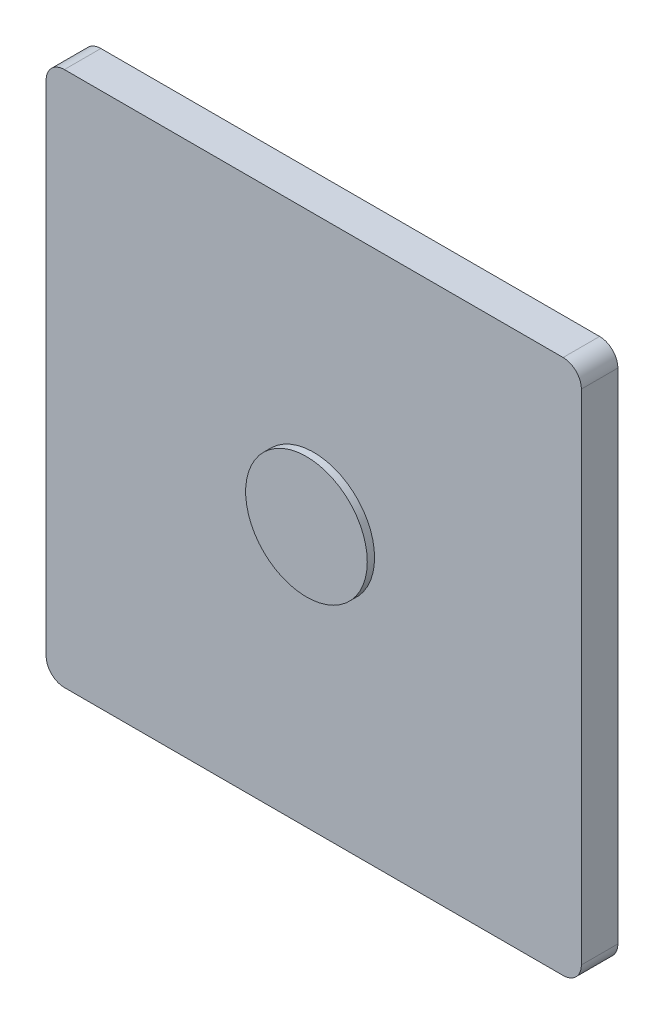
ISO-10303-21;
HEADER;
FILE_DESCRIPTION(('STEP AP214'),'2;1');
FILE_NAME('part.step','',(''),(''),'','','');
FILE_SCHEMA(('AUTOMOTIVE_DESIGN { 1 0 10303 214 1 1 1 1 }'));
ENDSEC;
DATA;
#1=APPLICATION_CONTEXT('core data for automotive mechanical design processes');
#2=APPLICATION_PROTOCOL_DEFINITION('international standard','automotive_design',2000,#1);
#3=PRODUCT_CONTEXT('',#1,'mechanical');
#4=PRODUCT('Part','Part','',(#3));
#5=PRODUCT_RELATED_PRODUCT_CATEGORY('part','',(#4));
#6=PRODUCT_DEFINITION_FORMATION('','',#4);
#7=PRODUCT_DEFINITION_CONTEXT('part definition',#1,'design');
#8=PRODUCT_DEFINITION('design','',#6,#7);
#9=PRODUCT_DEFINITION_SHAPE('','',#8);
#10=(LENGTH_UNIT() NAMED_UNIT(*) SI_UNIT(.MILLI.,.METRE.));
#11=(NAMED_UNIT(*) PLANE_ANGLE_UNIT() SI_UNIT($,.RADIAN.));
#12=(NAMED_UNIT(*) SI_UNIT($,.STERADIAN.) SOLID_ANGLE_UNIT());
#13=UNCERTAINTY_MEASURE_WITH_UNIT(LENGTH_MEASURE(1.E-05),#10,'distance_accuracy_value','');
#14=(GEOMETRIC_REPRESENTATION_CONTEXT(3) GLOBAL_UNCERTAINTY_ASSIGNED_CONTEXT((#13)) GLOBAL_UNIT_ASSIGNED_CONTEXT((#10,
#11,#12)) REPRESENTATION_CONTEXT('',''));
#15=CARTESIAN_POINT('',(0.,0.,0.));
#16=DIRECTION('',(0.,0.,1.));
#17=DIRECTION('',(1.,0.,0.));
#18=AXIS2_PLACEMENT_3D('',#15,#16,#17);
#19=CARTESIAN_POINT('',(-20.4999999991426,20.5,3.));
#20=DIRECTION('',(0.,0.,1.));
#21=DIRECTION('',(1.,0.,0.));
#22=AXIS2_PLACEMENT_3D('',#19,#20,#21);
#23=PLANE('',#22);
#24=DIRECTION('',(0.,-1.,0.));
#25=VECTOR('',#24,1.);
#26=CARTESIAN_POINT('',(-22.0000000004282,-20.500000000428,3.));
#27=LINE('',#26,#25);
#28=CARTESIAN_POINT('',(-22.0000000004283,20.5,3.));
#29=VERTEX_POINT('',#28);
#30=CARTESIAN_POINT('',(-22.0000000002139,-20.500000000428,3.));
#31=VERTEX_POINT('',#30);
#32=EDGE_CURVE('E50',#29,#31,#27,.T.);
#33=ORIENTED_EDGE('',*,*,#32,.T.);
#34=CARTESIAN_POINT('',(-20.4999999987139,-20.500000000428,3.));
#35=DIRECTION('',(0.,0.,1.));
#36=DIRECTION('',(1.,0.,0.));
#37=AXIS2_PLACEMENT_3D('',#34,#35,#36);
#38=CIRCLE('',#37,1.50000000150003);
#39=CARTESIAN_POINT('',(-20.4999999987139,-22.0000000017137,3.));
#40=VERTEX_POINT('',#39);
#41=EDGE_CURVE('E93',#31,#40,#38,.T.);
#42=ORIENTED_EDGE('',*,*,#41,.T.);
#43=DIRECTION('',(1.,0.,0.));
#44=VECTOR('',#43,1.);
#45=CARTESIAN_POINT('',(1.28580863396755E-09,-22.0000000017137,3.));
#46=LINE('',#45,#44);
#47=CARTESIAN_POINT('',(20.5000000017142,-22.0000000014993,3.));
#48=VERTEX_POINT('',#47);
#49=EDGE_CURVE('E163',#40,#48,#46,.T.);
#50=ORIENTED_EDGE('',*,*,#49,.T.);
#51=CARTESIAN_POINT('',(20.5000000017142,-20.4999999999993,3.));
#52=DIRECTION('',(0.,0.,1.));
#53=DIRECTION('',(1.,0.,0.));
#54=AXIS2_PLACEMENT_3D('',#51,#52,#53);
#55=CIRCLE('',#54,1.50000000150004);
#56=CARTESIAN_POINT('',(22.0000000029998,-20.4999999999993,3.));
#57=VERTEX_POINT('',#56);
#58=EDGE_CURVE('E175',#48,#57,#55,.T.);
#59=ORIENTED_EDGE('',*,*,#58,.T.);
#60=DIRECTION('',(0.,1.,0.));
#61=VECTOR('',#60,1.);
#62=CARTESIAN_POINT('',(22.0000000029998,3.69095781000377E-13,3.));
#63=LINE('',#62,#61);
#64=CARTESIAN_POINT('',(22.0000000027855,20.5000000004287,3.));
#65=VERTEX_POINT('',#64);
#66=EDGE_CURVE('E113',#57,#65,#63,.T.);
#67=ORIENTED_EDGE('',*,*,#66,.T.);
#68=CARTESIAN_POINT('',(20.5000000012855,20.5000000004287,3.));
#69=DIRECTION('',(0.,0.,1.));
#70=DIRECTION('',(1.,0.,0.));
#71=AXIS2_PLACEMENT_3D('',#68,#69,#70);
#72=CIRCLE('',#71,1.50000000150003);
#73=CARTESIAN_POINT('',(20.5000000012855,22.0000000017144,3.));
#74=VERTEX_POINT('',#73);
#75=EDGE_CURVE('E107',#65,#74,#72,.T.);
#76=ORIENTED_EDGE('',*,*,#75,.T.);
#77=DIRECTION('',(-1.,0.,0.));
#78=VECTOR('',#77,1.);
#79=CARTESIAN_POINT('',(1.28578977440685E-09,22.0000000017144,3.));
#80=LINE('',#79,#78);
#81=CARTESIAN_POINT('',(-20.4999999991426,22.0000000015001,3.));
#82=VERTEX_POINT('',#81);
#83=EDGE_CURVE('E111',#74,#82,#80,.T.);
#84=ORIENTED_EDGE('',*,*,#83,.T.);
#85=CARTESIAN_POINT('',(-20.4999999991426,20.5,3.));
#86=DIRECTION('',(0.,0.,1.));
#87=DIRECTION('',(1.,0.,0.));
#88=AXIS2_PLACEMENT_3D('',#85,#86,#87);
#89=CIRCLE('',#88,1.50000000150004);
#90=EDGE_CURVE('E128',#82,#29,#89,.T.);
#91=ORIENTED_EDGE('',*,*,#90,.T.);
#92=EDGE_LOOP('',(#33,#42,#50,#59,#67,#76,#84,#91));
#93=FACE_BOUND('',#92,.T.);
#94=CARTESIAN_POINT('',(0.,0.,3.));
#95=DIRECTION('',(0.,0.,1.));
#96=DIRECTION('',(1.,0.,0.));
#97=AXIS2_PLACEMENT_3D('',#94,#95,#96);
#98=CIRCLE('',#97,5.);
#99=CARTESIAN_POINT('',(5.,0.,3.));
#100=VERTEX_POINT('',#99);
#101=EDGE_CURVE('E181',#100,#100,#98,.T.);
#102=ORIENTED_EDGE('',*,*,#101,.F.);
#103=EDGE_LOOP('',(#102));
#104=FACE_BOUND('',#103,.T.);
#105=ADVANCED_FACE('F33',(#93,#104),#23,.T.);
#106=CARTESIAN_POINT('',(-20.4999999987139,-20.500000000428,3.));
#107=DIRECTION('',(0.,0.,-1.));
#108=DIRECTION('',(-1.,0.,0.));
#109=AXIS2_PLACEMENT_3D('',#106,#107,#108);
#110=CYLINDRICAL_SURFACE('',#109,1.50000000150003);
#111=CARTESIAN_POINT('',(-20.4999999987139,-20.500000000428,0.));
#112=DIRECTION('',(0.,0.,1.));
#113=DIRECTION('',(1.,0.,0.));
#114=AXIS2_PLACEMENT_3D('',#111,#112,#113);
#115=CIRCLE('',#114,1.50000000150003);
#116=CARTESIAN_POINT('',(-22.0000000002139,-20.500000000428,0.));
#117=VERTEX_POINT('',#116);
#118=CARTESIAN_POINT('',(-20.4999999987139,-22.0000000017137,0.));
#119=VERTEX_POINT('',#118);
#120=EDGE_CURVE('E134',#117,#119,#115,.T.);
#121=ORIENTED_EDGE('',*,*,#120,.T.);
#122=DIRECTION('',(0.,0.,-1.));
#123=VECTOR('',#122,1.);
#124=CARTESIAN_POINT('',(-20.4999999987139,-22.0000000017137,3.));
#125=LINE('',#124,#123);
#126=EDGE_CURVE('E42',#40,#119,#125,.T.);
#127=ORIENTED_EDGE('',*,*,#126,.F.);
#128=ORIENTED_EDGE('',*,*,#41,.F.);
#129=DIRECTION('',(0.,0.,-1.));
#130=VECTOR('',#129,1.);
#131=CARTESIAN_POINT('',(-22.0000000002139,-20.500000000428,3.));
#132=LINE('',#131,#130);
#133=EDGE_CURVE('E11',#31,#117,#132,.T.);
#134=ORIENTED_EDGE('',*,*,#133,.T.);
#135=EDGE_LOOP('',(#121,#127,#128,#134));
#136=FACE_BOUND('',#135,.T.);
#137=ADVANCED_FACE('F35',(#136),#110,.T.);
#138=CARTESIAN_POINT('',(20.5000000017142,-22.0000000017137,3.));
#139=DIRECTION('',(0.,1.,0.));
#140=DIRECTION('',(-1.,0.,0.));
#141=AXIS2_PLACEMENT_3D('',#138,#139,#140);
#142=PLANE('',#141);
#143=DIRECTION('',(1.,0.,0.));
#144=VECTOR('',#143,1.);
#145=CARTESIAN_POINT('',(20.5000000017142,-22.0000000017137,0.));
#146=LINE('',#145,#144);
#147=CARTESIAN_POINT('',(20.5000000017142,-22.0000000014993,0.));
#148=VERTEX_POINT('',#147);
#149=EDGE_CURVE('E137',#119,#148,#146,.T.);
#150=ORIENTED_EDGE('',*,*,#149,.T.);
#151=DIRECTION('',(0.,0.,-1.));
#152=VECTOR('',#151,1.);
#153=CARTESIAN_POINT('',(20.5000000017142,-22.0000000014993,3.));
#154=LINE('',#153,#152);
#155=EDGE_CURVE('E156',#48,#148,#154,.T.);
#156=ORIENTED_EDGE('',*,*,#155,.F.);
#157=ORIENTED_EDGE('',*,*,#49,.F.);
#158=ORIENTED_EDGE('',*,*,#126,.T.);
#159=EDGE_LOOP('',(#150,#156,#157,#158));
#160=FACE_BOUND('',#159,.T.);
#161=ADVANCED_FACE('F161',(#160),#142,.F.);
#162=CARTESIAN_POINT('',(20.5000000017142,-20.4999999999993,3.));
#163=DIRECTION('',(0.,0.,-1.));
#164=DIRECTION('',(-1.,0.,0.));
#165=AXIS2_PLACEMENT_3D('',#162,#163,#164);
#166=CYLINDRICAL_SURFACE('',#165,1.50000000150004);
#167=CARTESIAN_POINT('',(20.5000000017142,-20.4999999999993,0.));
#168=DIRECTION('',(0.,0.,1.));
#169=DIRECTION('',(1.,0.,0.));
#170=AXIS2_PLACEMENT_3D('',#167,#168,#169);
#171=CIRCLE('',#170,1.50000000150004);
#172=CARTESIAN_POINT('',(22.0000000029998,-20.4999999999993,0.));
#173=VERTEX_POINT('',#172);
#174=EDGE_CURVE('E140',#148,#173,#171,.T.);
#175=ORIENTED_EDGE('',*,*,#174,.T.);
#176=DIRECTION('',(0.,0.,-1.));
#177=VECTOR('',#176,1.);
#178=CARTESIAN_POINT('',(22.0000000029998,-20.4999999999993,3.));
#179=LINE('',#178,#177);
#180=EDGE_CURVE('E153',#57,#173,#179,.T.);
#181=ORIENTED_EDGE('',*,*,#180,.F.);
#182=ORIENTED_EDGE('',*,*,#58,.F.);
#183=ORIENTED_EDGE('',*,*,#155,.T.);
#184=EDGE_LOOP('',(#175,#181,#182,#183));
#185=FACE_BOUND('',#184,.T.);
#186=ADVANCED_FACE('F171',(#185),#166,.T.);
#187=CARTESIAN_POINT('',(22.0000000029998,20.5000000004287,3.));
#188=DIRECTION('',(-1.,0.,0.));
#189=DIRECTION('',(0.,-1.,0.));
#190=AXIS2_PLACEMENT_3D('',#187,#188,#189);
#191=PLANE('',#190);
#192=DIRECTION('',(0.,1.,0.));
#193=VECTOR('',#192,1.);
#194=CARTESIAN_POINT('',(22.0000000029998,20.5000000004287,0.));
#195=LINE('',#194,#193);
#196=CARTESIAN_POINT('',(22.0000000027855,20.5000000004287,0.));
#197=VERTEX_POINT('',#196);
#198=EDGE_CURVE('E143',#173,#197,#195,.T.);
#199=ORIENTED_EDGE('',*,*,#198,.T.);
#200=DIRECTION('',(0.,0.,-1.));
#201=VECTOR('',#200,1.);
#202=CARTESIAN_POINT('',(22.0000000027855,20.5000000004287,3.));
#203=LINE('',#202,#201);
#204=EDGE_CURVE('E123',#65,#197,#203,.T.);
#205=ORIENTED_EDGE('',*,*,#204,.F.);
#206=ORIENTED_EDGE('',*,*,#66,.F.);
#207=ORIENTED_EDGE('',*,*,#180,.T.);
#208=EDGE_LOOP('',(#199,#205,#206,#207));
#209=FACE_BOUND('',#208,.T.);
#210=ADVANCED_FACE('F174',(#209),#191,.F.);
#211=CARTESIAN_POINT('',(20.5000000012855,20.5000000004287,3.));
#212=DIRECTION('',(0.,0.,-1.));
#213=DIRECTION('',(-1.,0.,0.));
#214=AXIS2_PLACEMENT_3D('',#211,#212,#213);
#215=CYLINDRICAL_SURFACE('',#214,1.50000000150003);
#216=CARTESIAN_POINT('',(20.5000000012855,20.5000000004287,0.));
#217=DIRECTION('',(0.,0.,1.));
#218=DIRECTION('',(1.,0.,0.));
#219=AXIS2_PLACEMENT_3D('',#216,#217,#218);
#220=CIRCLE('',#219,1.50000000150003);
#221=CARTESIAN_POINT('',(20.5000000012855,22.0000000017144,0.));
#222=VERTEX_POINT('',#221);
#223=EDGE_CURVE('E122',#197,#222,#220,.T.);
#224=ORIENTED_EDGE('',*,*,#223,.T.);
#225=DIRECTION('',(0.,0.,-1.));
#226=VECTOR('',#225,1.);
#227=CARTESIAN_POINT('',(20.5000000012855,22.0000000017144,3.));
#228=LINE('',#227,#226);
#229=EDGE_CURVE('E119',#74,#222,#228,.T.);
#230=ORIENTED_EDGE('',*,*,#229,.F.);
#231=ORIENTED_EDGE('',*,*,#75,.F.);
#232=ORIENTED_EDGE('',*,*,#204,.T.);
#233=EDGE_LOOP('',(#224,#230,#231,#232));
#234=FACE_BOUND('',#233,.T.);
#235=ADVANCED_FACE('F120',(#234),#215,.T.);
#236=CARTESIAN_POINT('',(-20.4999999991426,22.0000000017144,3.));
#237=DIRECTION('',(0.,-1.,0.));
#238=DIRECTION('',(1.,0.,0.));
#239=AXIS2_PLACEMENT_3D('',#236,#237,#238);
#240=PLANE('',#239);
#241=DIRECTION('',(-1.,0.,0.));
#242=VECTOR('',#241,1.);
#243=CARTESIAN_POINT('',(-20.4999999991426,22.0000000017144,0.));
#244=LINE('',#243,#242);
#245=CARTESIAN_POINT('',(-20.4999999991426,22.0000000015001,0.));
#246=VERTEX_POINT('',#245);
#247=EDGE_CURVE('E79',#222,#246,#244,.T.);
#248=ORIENTED_EDGE('',*,*,#247,.T.);
#249=DIRECTION('',(0.,0.,-1.));
#250=VECTOR('',#249,1.);
#251=CARTESIAN_POINT('',(-20.4999999991426,22.0000000015001,3.));
#252=LINE('',#251,#250);
#253=EDGE_CURVE('E124',#82,#246,#252,.T.);
#254=ORIENTED_EDGE('',*,*,#253,.F.);
#255=ORIENTED_EDGE('',*,*,#83,.F.);
#256=ORIENTED_EDGE('',*,*,#229,.T.);
#257=EDGE_LOOP('',(#248,#254,#255,#256));
#258=FACE_BOUND('',#257,.T.);
#259=ADVANCED_FACE('F126',(#258),#240,.F.);
#260=CARTESIAN_POINT('',(-20.4999999991426,20.5,3.));
#261=DIRECTION('',(0.,0.,-1.));
#262=DIRECTION('',(-1.,0.,0.));
#263=AXIS2_PLACEMENT_3D('',#260,#261,#262);
#264=CYLINDRICAL_SURFACE('',#263,1.50000000150004);
#265=CARTESIAN_POINT('',(-20.4999999991426,20.5,0.));
#266=DIRECTION('',(0.,0.,1.));
#267=DIRECTION('',(1.,0.,0.));
#268=AXIS2_PLACEMENT_3D('',#265,#266,#267);
#269=CIRCLE('',#268,1.50000000150004);
#270=CARTESIAN_POINT('',(-22.0000000004283,20.5,0.));
#271=VERTEX_POINT('',#270);
#272=EDGE_CURVE('E86',#246,#271,#269,.T.);
#273=ORIENTED_EDGE('',*,*,#272,.T.);
#274=DIRECTION('',(0.,0.,-1.));
#275=VECTOR('',#274,1.);
#276=CARTESIAN_POINT('',(-22.0000000004283,20.5,3.));
#277=LINE('',#276,#275);
#278=EDGE_CURVE('E130',#29,#271,#277,.T.);
#279=ORIENTED_EDGE('',*,*,#278,.F.);
#280=ORIENTED_EDGE('',*,*,#90,.F.);
#281=ORIENTED_EDGE('',*,*,#253,.T.);
#282=EDGE_LOOP('',(#273,#279,#280,#281));
#283=FACE_BOUND('',#282,.T.);
#284=ADVANCED_FACE('F206',(#283),#264,.T.);
#285=CARTESIAN_POINT('',(-22.0000000004282,0.,3.));
#286=DIRECTION('',(1.,0.,0.));
#287=DIRECTION('',(0.,1.,0.));
#288=AXIS2_PLACEMENT_3D('',#285,#286,#287);
#289=PLANE('',#288);
#290=DIRECTION('',(0.,-1.,0.));
#291=VECTOR('',#290,1.);
#292=CARTESIAN_POINT('',(-22.0000000004282,0.,0.));
#293=LINE('',#292,#291);
#294=EDGE_CURVE('E148',#271,#117,#293,.T.);
#295=ORIENTED_EDGE('',*,*,#294,.T.);
#296=ORIENTED_EDGE('',*,*,#133,.F.);
#297=ORIENTED_EDGE('',*,*,#32,.F.);
#298=ORIENTED_EDGE('',*,*,#278,.T.);
#299=EDGE_LOOP('',(#295,#296,#297,#298));
#300=FACE_BOUND('',#299,.T.);
#301=ADVANCED_FACE('F203',(#300),#289,.F.);
#302=CARTESIAN_POINT('',(-20.4999999991426,20.5,0.));
#303=DIRECTION('',(0.,0.,1.));
#304=DIRECTION('',(1.,0.,0.));
#305=AXIS2_PLACEMENT_3D('',#302,#303,#304);
#306=PLANE('',#305);
#307=ORIENTED_EDGE('',*,*,#120,.F.);
#308=ORIENTED_EDGE('',*,*,#294,.F.);
#309=ORIENTED_EDGE('',*,*,#272,.F.);
#310=ORIENTED_EDGE('',*,*,#247,.F.);
#311=ORIENTED_EDGE('',*,*,#223,.F.);
#312=ORIENTED_EDGE('',*,*,#198,.F.);
#313=ORIENTED_EDGE('',*,*,#174,.F.);
#314=ORIENTED_EDGE('',*,*,#149,.F.);
#315=EDGE_LOOP('',(#307,#308,#309,#310,#311,#312,#313,#314));
#316=FACE_BOUND('',#315,.T.);
#317=ADVANCED_FACE('F167',(#316),#306,.F.);
#318=CARTESIAN_POINT('',(0.,0.,3.6));
#319=DIRECTION('',(0.,0.,-1.));
#320=DIRECTION('',(-1.,0.,0.));
#321=AXIS2_PLACEMENT_3D('',#318,#319,#320);
#322=CYLINDRICAL_SURFACE('',#321,5.);
#323=CARTESIAN_POINT('',(0.,0.,3.6));
#324=DIRECTION('',(0.,0.,1.));
#325=DIRECTION('',(1.,0.,0.));
#326=AXIS2_PLACEMENT_3D('',#323,#324,#325);
#327=CIRCLE('',#326,5.);
#328=CARTESIAN_POINT('',(5.,0.,3.6));
#329=VERTEX_POINT('',#328);
#330=EDGE_CURVE('E138',#329,#329,#327,.T.);
#331=ORIENTED_EDGE('',*,*,#330,.F.);
#332=EDGE_LOOP('',(#331));
#333=FACE_BOUND('',#332,.T.);
#334=ORIENTED_EDGE('',*,*,#101,.T.);
#335=EDGE_LOOP('',(#334));
#336=FACE_BOUND('',#335,.T.);
#337=ADVANCED_FACE('F189',(#333,#336),#322,.T.);
#338=CARTESIAN_POINT('',(0.,0.,3.6));
#339=DIRECTION('',(0.,0.,1.));
#340=DIRECTION('',(1.,0.,0.));
#341=AXIS2_PLACEMENT_3D('',#338,#339,#340);
#342=PLANE('',#341);
#343=ORIENTED_EDGE('',*,*,#330,.T.);
#344=EDGE_LOOP('',(#343));
#345=FACE_BOUND('',#344,.T.);
#346=ADVANCED_FACE('F187',(#345),#342,.T.);
#347=CLOSED_SHELL('',(#105,#137,#161,#186,#210,#235,#259,#284,#301,#317,#337,#346));
#348=MANIFOLD_SOLID_BREP('B2',#347);
#349=ADVANCED_BREP_SHAPE_REPRESENTATION('',(#18,#348),#14);
#350=SHAPE_DEFINITION_REPRESENTATION(#9,#349);
ENDSEC;
END-ISO-10303-21;
